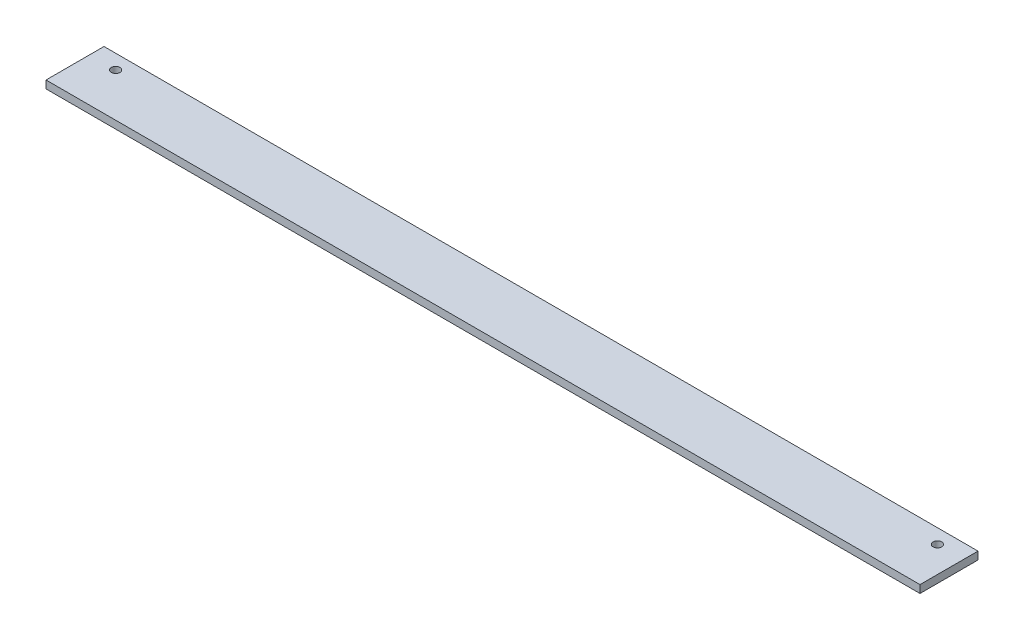
ISO-10303-21;
HEADER;
FILE_DESCRIPTION(('STEP AP214'),'2;1');
FILE_NAME('part.step','',(''),(''),'','','');
FILE_SCHEMA(('AUTOMOTIVE_DESIGN { 1 0 10303 214 1 1 1 1 }'));
ENDSEC;
DATA;
#1=APPLICATION_CONTEXT('core data for automotive mechanical design processes');
#2=APPLICATION_PROTOCOL_DEFINITION('international standard','automotive_design',2000,#1);
#3=PRODUCT_CONTEXT('',#1,'mechanical');
#4=PRODUCT('Part','Part','',(#3));
#5=PRODUCT_RELATED_PRODUCT_CATEGORY('part','',(#4));
#6=PRODUCT_DEFINITION_FORMATION('','',#4);
#7=PRODUCT_DEFINITION_CONTEXT('part definition',#1,'design');
#8=PRODUCT_DEFINITION('design','',#6,#7);
#9=PRODUCT_DEFINITION_SHAPE('','',#8);
#10=(LENGTH_UNIT() NAMED_UNIT(*) SI_UNIT(.MILLI.,.METRE.));
#11=(NAMED_UNIT(*) PLANE_ANGLE_UNIT() SI_UNIT($,.RADIAN.));
#12=(NAMED_UNIT(*) SI_UNIT($,.STERADIAN.) SOLID_ANGLE_UNIT());
#13=UNCERTAINTY_MEASURE_WITH_UNIT(LENGTH_MEASURE(1.E-05),#10,'distance_accuracy_value','');
#14=(GEOMETRIC_REPRESENTATION_CONTEXT(3) GLOBAL_UNCERTAINTY_ASSIGNED_CONTEXT((#13)) GLOBAL_UNIT_ASSIGNED_CONTEXT((#10,
#11,#12)) REPRESENTATION_CONTEXT('',''));
#15=CARTESIAN_POINT('',(0.,0.,0.));
#16=DIRECTION('',(0.,0.,1.));
#17=DIRECTION('',(1.,0.,0.));
#18=AXIS2_PLACEMENT_3D('',#15,#16,#17);
#19=CARTESIAN_POINT('',(452.,-2.,-15.));
#20=DIRECTION('',(0.,0.,1.));
#21=DIRECTION('',(1.,0.,0.));
#22=AXIS2_PLACEMENT_3D('',#19,#20,#21);
#23=PLANE('',#22);
#24=DIRECTION('',(0.,1.,0.));
#25=VECTOR('',#24,1.);
#26=CARTESIAN_POINT('',(0.,-2.,-15.));
#27=LINE('',#26,#25);
#28=CARTESIAN_POINT('',(0.,-2.,-15.));
#29=VERTEX_POINT('',#28);
#30=CARTESIAN_POINT('',(0.,2.,-15.));
#31=VERTEX_POINT('',#30);
#32=EDGE_CURVE('E98',#29,#31,#27,.T.);
#33=ORIENTED_EDGE('',*,*,#32,.T.);
#34=DIRECTION('',(-1.,0.,0.));
#35=VECTOR('',#34,1.);
#36=CARTESIAN_POINT('',(452.,2.,-15.));
#37=LINE('',#36,#35);
#38=CARTESIAN_POINT('',(452.,2.,-15.));
#39=VERTEX_POINT('',#38);
#40=EDGE_CURVE('E11',#39,#31,#37,.T.);
#41=ORIENTED_EDGE('',*,*,#40,.F.);
#42=DIRECTION('',(0.,1.,0.));
#43=VECTOR('',#42,1.);
#44=CARTESIAN_POINT('',(452.,-2.,-15.));
#45=LINE('',#44,#43);
#46=CARTESIAN_POINT('',(452.,-2.,-15.));
#47=VERTEX_POINT('',#46);
#48=EDGE_CURVE('E86',#47,#39,#45,.T.);
#49=ORIENTED_EDGE('',*,*,#48,.F.);
#50=DIRECTION('',(-1.,0.,0.));
#51=VECTOR('',#50,1.);
#52=CARTESIAN_POINT('',(452.,-2.,-15.));
#53=LINE('',#52,#51);
#54=EDGE_CURVE('E94',#47,#29,#53,.T.);
#55=ORIENTED_EDGE('',*,*,#54,.T.);
#56=EDGE_LOOP('',(#33,#41,#49,#55));
#57=FACE_BOUND('',#56,.T.);
#58=ADVANCED_FACE('F35',(#57),#23,.F.);
#59=CARTESIAN_POINT('',(452.,2.,15.));
#60=DIRECTION('',(0.,-1.,0.));
#61=DIRECTION('',(0.,0.,-1.));
#62=AXIS2_PLACEMENT_3D('',#59,#60,#61);
#63=PLANE('',#62);
#64=CARTESIAN_POINT('',(13.5,2.,-7.5));
#65=DIRECTION('',(0.,1.,0.));
#66=DIRECTION('',(0.,0.,1.));
#67=AXIS2_PLACEMENT_3D('',#64,#65,#66);
#68=CIRCLE('',#67,2.25);
#69=CARTESIAN_POINT('',(13.5,2.,-5.25));
#70=VERTEX_POINT('',#69);
#71=EDGE_CURVE('E118',#70,#70,#68,.T.);
#72=ORIENTED_EDGE('',*,*,#71,.F.);
#73=EDGE_LOOP('',(#72));
#74=FACE_BOUND('',#73,.T.);
#75=CARTESIAN_POINT('',(438.5,2.,-7.5));
#76=DIRECTION('',(0.,1.,0.));
#77=DIRECTION('',(0.,0.,1.));
#78=AXIS2_PLACEMENT_3D('',#75,#76,#77);
#79=CIRCLE('',#78,2.24999999999995);
#80=CARTESIAN_POINT('',(438.5,2.,-5.25000000000005));
#81=VERTEX_POINT('',#80);
#82=EDGE_CURVE('E112',#81,#81,#79,.T.);
#83=ORIENTED_EDGE('',*,*,#82,.F.);
#84=EDGE_LOOP('',(#83));
#85=FACE_BOUND('',#84,.T.);
#86=DIRECTION('',(0.,0.,1.));
#87=VECTOR('',#86,1.);
#88=CARTESIAN_POINT('',(0.,2.,15.));
#89=LINE('',#88,#87);
#90=CARTESIAN_POINT('',(0.,2.,15.));
#91=VERTEX_POINT('',#90);
#92=EDGE_CURVE('E90',#31,#91,#89,.T.);
#93=ORIENTED_EDGE('',*,*,#92,.T.);
#94=DIRECTION('',(-1.,0.,0.));
#95=VECTOR('',#94,1.);
#96=CARTESIAN_POINT('',(452.,2.,15.));
#97=LINE('',#96,#95);
#98=CARTESIAN_POINT('',(452.,2.,15.));
#99=VERTEX_POINT('',#98);
#100=EDGE_CURVE('E43',#99,#91,#97,.T.);
#101=ORIENTED_EDGE('',*,*,#100,.F.);
#102=DIRECTION('',(0.,0.,1.));
#103=VECTOR('',#102,1.);
#104=CARTESIAN_POINT('',(452.,2.,15.));
#105=LINE('',#104,#103);
#106=EDGE_CURVE('E81',#39,#99,#105,.T.);
#107=ORIENTED_EDGE('',*,*,#106,.F.);
#108=ORIENTED_EDGE('',*,*,#40,.T.);
#109=EDGE_LOOP('',(#93,#101,#107,#108));
#110=FACE_BOUND('',#109,.T.);
#111=ADVANCED_FACE('F89',(#74,#85,#110),#63,.F.);
#112=CARTESIAN_POINT('',(452.,-2.,15.));
#113=DIRECTION('',(0.,0.,-1.));
#114=DIRECTION('',(-1.,0.,0.));
#115=AXIS2_PLACEMENT_3D('',#112,#113,#114);
#116=PLANE('',#115);
#117=DIRECTION('',(0.,-1.,0.));
#118=VECTOR('',#117,1.);
#119=CARTESIAN_POINT('',(0.,-2.,15.));
#120=LINE('',#119,#118);
#121=CARTESIAN_POINT('',(0.,-2.,15.));
#122=VERTEX_POINT('',#121);
#123=EDGE_CURVE('E68',#91,#122,#120,.T.);
#124=ORIENTED_EDGE('',*,*,#123,.T.);
#125=DIRECTION('',(-1.,0.,0.));
#126=VECTOR('',#125,1.);
#127=CARTESIAN_POINT('',(452.,-2.,15.));
#128=LINE('',#127,#126);
#129=CARTESIAN_POINT('',(452.,-2.,15.));
#130=VERTEX_POINT('',#129);
#131=EDGE_CURVE('E91',#130,#122,#128,.T.);
#132=ORIENTED_EDGE('',*,*,#131,.F.);
#133=DIRECTION('',(0.,-1.,0.));
#134=VECTOR('',#133,1.);
#135=CARTESIAN_POINT('',(452.,-2.,15.));
#136=LINE('',#135,#134);
#137=EDGE_CURVE('E84',#99,#130,#136,.T.);
#138=ORIENTED_EDGE('',*,*,#137,.F.);
#139=ORIENTED_EDGE('',*,*,#100,.T.);
#140=EDGE_LOOP('',(#124,#132,#138,#139));
#141=FACE_BOUND('',#140,.T.);
#142=ADVANCED_FACE('F92',(#141),#116,.F.);
#143=CARTESIAN_POINT('',(452.,-2.,15.));
#144=DIRECTION('',(0.,1.,0.));
#145=DIRECTION('',(0.,0.,1.));
#146=AXIS2_PLACEMENT_3D('',#143,#144,#145);
#147=PLANE('',#146);
#148=CARTESIAN_POINT('',(13.5,-2.,-7.5));
#149=DIRECTION('',(0.,1.,0.));
#150=DIRECTION('',(0.,0.,1.));
#151=AXIS2_PLACEMENT_3D('',#148,#149,#150);
#152=CIRCLE('',#151,2.25);
#153=CARTESIAN_POINT('',(13.5,-2.,-5.25));
#154=VERTEX_POINT('',#153);
#155=EDGE_CURVE('E101',#154,#154,#152,.T.);
#156=ORIENTED_EDGE('',*,*,#155,.T.);
#157=EDGE_LOOP('',(#156));
#158=FACE_BOUND('',#157,.T.);
#159=CARTESIAN_POINT('',(438.5,-2.,-7.5));
#160=DIRECTION('',(0.,1.,0.));
#161=DIRECTION('',(0.,0.,1.));
#162=AXIS2_PLACEMENT_3D('',#159,#160,#161);
#163=CIRCLE('',#162,2.24999999999995);
#164=CARTESIAN_POINT('',(438.5,-2.,-5.25000000000005));
#165=VERTEX_POINT('',#164);
#166=EDGE_CURVE('E115',#165,#165,#163,.T.);
#167=ORIENTED_EDGE('',*,*,#166,.T.);
#168=EDGE_LOOP('',(#167));
#169=FACE_BOUND('',#168,.T.);
#170=DIRECTION('',(0.,0.,-1.));
#171=VECTOR('',#170,1.);
#172=CARTESIAN_POINT('',(0.,-2.,15.));
#173=LINE('',#172,#171);
#174=EDGE_CURVE('E74',#122,#29,#173,.T.);
#175=ORIENTED_EDGE('',*,*,#174,.T.);
#176=ORIENTED_EDGE('',*,*,#54,.F.);
#177=DIRECTION('',(0.,0.,-1.));
#178=VECTOR('',#177,1.);
#179=CARTESIAN_POINT('',(452.,-2.,15.));
#180=LINE('',#179,#178);
#181=EDGE_CURVE('E51',#130,#47,#180,.T.);
#182=ORIENTED_EDGE('',*,*,#181,.F.);
#183=ORIENTED_EDGE('',*,*,#131,.T.);
#184=EDGE_LOOP('',(#175,#176,#182,#183));
#185=FACE_BOUND('',#184,.T.);
#186=ADVANCED_FACE('F106',(#158,#169,#185),#147,.F.);
#187=CARTESIAN_POINT('',(452.,0.,0.));
#188=DIRECTION('',(-1.,0.,0.));
#189=DIRECTION('',(0.,0.,1.));
#190=AXIS2_PLACEMENT_3D('',#187,#188,#189);
#191=PLANE('',#190);
#192=ORIENTED_EDGE('',*,*,#48,.T.);
#193=ORIENTED_EDGE('',*,*,#106,.T.);
#194=ORIENTED_EDGE('',*,*,#137,.T.);
#195=ORIENTED_EDGE('',*,*,#181,.T.);
#196=EDGE_LOOP('',(#192,#193,#194,#195));
#197=FACE_BOUND('',#196,.T.);
#198=ADVANCED_FACE('F82',(#197),#191,.F.);
#199=CARTESIAN_POINT('',(0.,0.,0.));
#200=DIRECTION('',(-1.,0.,0.));
#201=DIRECTION('',(0.,0.,1.));
#202=AXIS2_PLACEMENT_3D('',#199,#200,#201);
#203=PLANE('',#202);
#204=ORIENTED_EDGE('',*,*,#32,.F.);
#205=ORIENTED_EDGE('',*,*,#174,.F.);
#206=ORIENTED_EDGE('',*,*,#123,.F.);
#207=ORIENTED_EDGE('',*,*,#92,.F.);
#208=EDGE_LOOP('',(#204,#205,#206,#207));
#209=FACE_BOUND('',#208,.T.);
#210=ADVANCED_FACE('F109',(#209),#203,.T.);
#211=CARTESIAN_POINT('',(438.5,-2.,-7.5));
#212=DIRECTION('',(0.,1.,0.));
#213=DIRECTION('',(0.,0.,1.));
#214=AXIS2_PLACEMENT_3D('',#211,#212,#213);
#215=CYLINDRICAL_SURFACE('',#214,2.24999999999995);
#216=ORIENTED_EDGE('',*,*,#166,.F.);
#217=EDGE_LOOP('',(#216));
#218=FACE_BOUND('',#217,.T.);
#219=ORIENTED_EDGE('',*,*,#82,.T.);
#220=EDGE_LOOP('',(#219));
#221=FACE_BOUND('',#220,.T.);
#222=ADVANCED_FACE('F129',(#218,#221),#215,.F.);
#223=CARTESIAN_POINT('',(13.5,-2.,-7.5));
#224=DIRECTION('',(0.,1.,0.));
#225=DIRECTION('',(0.,0.,1.));
#226=AXIS2_PLACEMENT_3D('',#223,#224,#225);
#227=CYLINDRICAL_SURFACE('',#226,2.25);
#228=ORIENTED_EDGE('',*,*,#155,.F.);
#229=EDGE_LOOP('',(#228));
#230=FACE_BOUND('',#229,.T.);
#231=ORIENTED_EDGE('',*,*,#71,.T.);
#232=EDGE_LOOP('',(#231));
#233=FACE_BOUND('',#232,.T.);
#234=ADVANCED_FACE('F126',(#230,#233),#227,.F.);
#235=CLOSED_SHELL('',(#58,#111,#142,#186,#198,#210,#222,#234));
#236=MANIFOLD_SOLID_BREP('B2',#235);
#237=ADVANCED_BREP_SHAPE_REPRESENTATION('',(#18,#236),#14);
#238=SHAPE_DEFINITION_REPRESENTATION(#9,#237);
ENDSEC;
END-ISO-10303-21;
